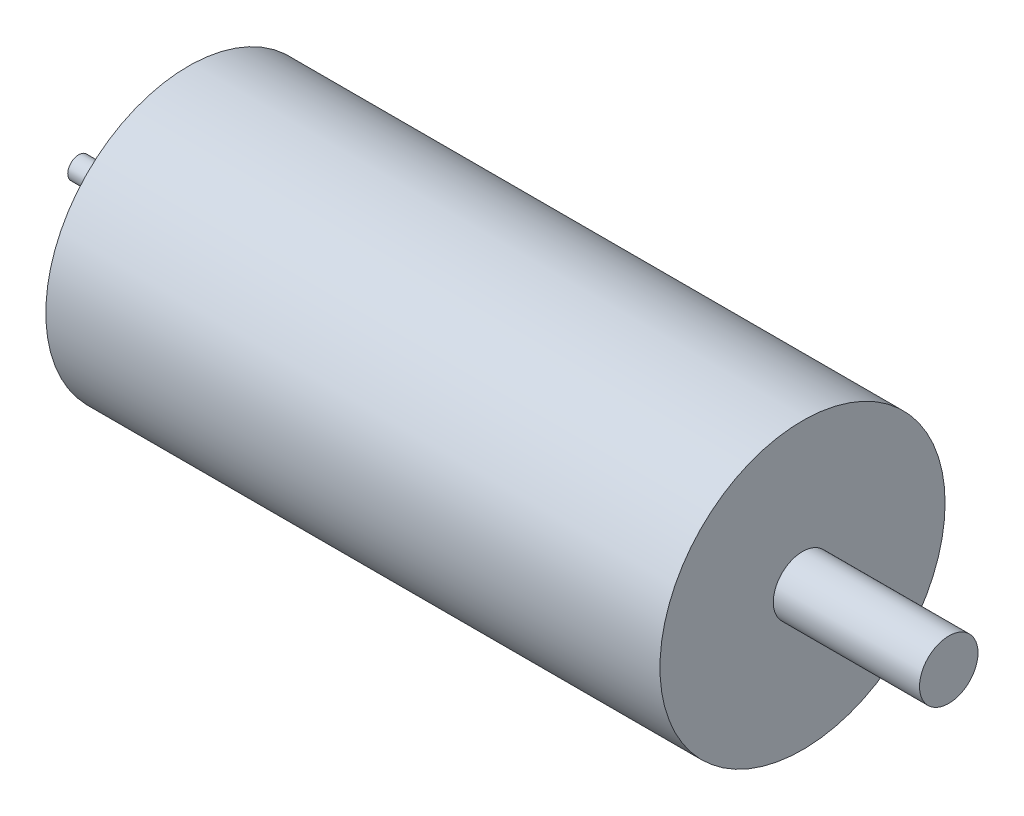
ISO-10303-21;
HEADER;
FILE_DESCRIPTION(('STEP AP214'),'2;1');
FILE_NAME('part.step','',(''),(''),'','','');
FILE_SCHEMA(('AUTOMOTIVE_DESIGN { 1 0 10303 214 1 1 1 1 }'));
ENDSEC;
DATA;
#1=APPLICATION_CONTEXT('core data for automotive mechanical design processes');
#2=APPLICATION_PROTOCOL_DEFINITION('international standard','automotive_design',2000,#1);
#3=PRODUCT_CONTEXT('',#1,'mechanical');
#4=PRODUCT('Part','Part','',(#3));
#5=PRODUCT_RELATED_PRODUCT_CATEGORY('part','',(#4));
#6=PRODUCT_DEFINITION_FORMATION('','',#4);
#7=PRODUCT_DEFINITION_CONTEXT('part definition',#1,'design');
#8=PRODUCT_DEFINITION('design','',#6,#7);
#9=PRODUCT_DEFINITION_SHAPE('','',#8);
#10=(LENGTH_UNIT() NAMED_UNIT(*) SI_UNIT(.MILLI.,.METRE.));
#11=(NAMED_UNIT(*) PLANE_ANGLE_UNIT() SI_UNIT($,.RADIAN.));
#12=(NAMED_UNIT(*) SI_UNIT($,.STERADIAN.) SOLID_ANGLE_UNIT());
#13=UNCERTAINTY_MEASURE_WITH_UNIT(LENGTH_MEASURE(1.E-05),#10,'distance_accuracy_value','');
#14=(GEOMETRIC_REPRESENTATION_CONTEXT(3) GLOBAL_UNCERTAINTY_ASSIGNED_CONTEXT((#13)) GLOBAL_UNIT_ASSIGNED_CONTEXT((#10,
#11,#12)) REPRESENTATION_CONTEXT('',''));
#15=CARTESIAN_POINT('',(0.,0.,0.));
#16=DIRECTION('',(0.,0.,1.));
#17=DIRECTION('',(1.,0.,0.));
#18=AXIS2_PLACEMENT_3D('',#15,#16,#17);
#19=CARTESIAN_POINT('',(84.,0.,0.));
#20=DIRECTION('',(-1.,0.,0.));
#21=DIRECTION('',(0.,0.,1.));
#22=AXIS2_PLACEMENT_3D('',#19,#20,#21);
#23=CYLINDRICAL_SURFACE('',#22,19.5);
#24=CARTESIAN_POINT('',(84.,0.,0.));
#25=DIRECTION('',(1.,0.,0.));
#26=DIRECTION('',(0.,0.,-1.));
#27=AXIS2_PLACEMENT_3D('',#24,#25,#26);
#28=CIRCLE('',#27,19.5);
#29=CARTESIAN_POINT('',(84.,0.,-19.5));
#30=VERTEX_POINT('',#29);
#31=EDGE_CURVE('E46',#30,#30,#28,.T.);
#32=ORIENTED_EDGE('',*,*,#31,.F.);
#33=EDGE_LOOP('',(#32));
#34=FACE_BOUND('',#33,.T.);
#35=CARTESIAN_POINT('',(0.,0.,0.));
#36=DIRECTION('',(1.,0.,0.));
#37=DIRECTION('',(0.,0.,-1.));
#38=AXIS2_PLACEMENT_3D('',#35,#36,#37);
#39=CIRCLE('',#38,19.5);
#40=CARTESIAN_POINT('',(0.,0.,-19.5));
#41=VERTEX_POINT('',#40);
#42=EDGE_CURVE('E51',#41,#41,#39,.T.);
#43=ORIENTED_EDGE('',*,*,#42,.T.);
#44=EDGE_LOOP('',(#43));
#45=FACE_BOUND('',#44,.T.);
#46=ADVANCED_FACE('F36',(#34,#45),#23,.T.);
#47=CARTESIAN_POINT('',(84.,0.,0.));
#48=DIRECTION('',(1.,0.,0.));
#49=DIRECTION('',(0.,0.,-1.));
#50=AXIS2_PLACEMENT_3D('',#47,#48,#49);
#51=PLANE('',#50);
#52=CARTESIAN_POINT('',(84.,0.,0.));
#53=DIRECTION('',(1.,0.,0.));
#54=DIRECTION('',(0.,0.,-1.));
#55=AXIS2_PLACEMENT_3D('',#52,#53,#54);
#56=CIRCLE('',#55,4.);
#57=CARTESIAN_POINT('',(84.,0.,-4.));
#58=VERTEX_POINT('',#57);
#59=EDGE_CURVE('E42',#58,#58,#56,.T.);
#60=ORIENTED_EDGE('',*,*,#59,.F.);
#61=EDGE_LOOP('',(#60));
#62=FACE_BOUND('',#61,.T.);
#63=ORIENTED_EDGE('',*,*,#31,.T.);
#64=EDGE_LOOP('',(#63));
#65=FACE_BOUND('',#64,.T.);
#66=ADVANCED_FACE('F80',(#62,#65),#51,.T.);
#67=CARTESIAN_POINT('',(0.,0.,0.));
#68=DIRECTION('',(1.,0.,0.));
#69=DIRECTION('',(0.,0.,-1.));
#70=AXIS2_PLACEMENT_3D('',#67,#68,#69);
#71=PLANE('',#70);
#72=CARTESIAN_POINT('',(0.,0.,0.));
#73=DIRECTION('',(1.,0.,0.));
#74=DIRECTION('',(0.,0.,-1.));
#75=AXIS2_PLACEMENT_3D('',#72,#73,#74);
#76=CIRCLE('',#75,1.5);
#77=CARTESIAN_POINT('',(0.,0.,-1.5));
#78=VERTEX_POINT('',#77);
#79=EDGE_CURVE('E10',#78,#78,#76,.F.);
#80=ORIENTED_EDGE('',*,*,#79,.F.);
#81=EDGE_LOOP('',(#80));
#82=FACE_BOUND('',#81,.T.);
#83=ORIENTED_EDGE('',*,*,#42,.F.);
#84=EDGE_LOOP('',(#83));
#85=FACE_BOUND('',#84,.T.);
#86=ADVANCED_FACE('F85',(#82,#85),#71,.F.);
#87=CARTESIAN_POINT('',(104.,0.,0.));
#88=DIRECTION('',(-1.,0.,0.));
#89=DIRECTION('',(0.,0.,1.));
#90=AXIS2_PLACEMENT_3D('',#87,#88,#89);
#91=CYLINDRICAL_SURFACE('',#90,4.);
#92=CARTESIAN_POINT('',(104.,0.,0.));
#93=DIRECTION('',(1.,0.,0.));
#94=DIRECTION('',(0.,0.,-1.));
#95=AXIS2_PLACEMENT_3D('',#92,#93,#94);
#96=CIRCLE('',#95,4.);
#97=CARTESIAN_POINT('',(104.,0.,-4.));
#98=VERTEX_POINT('',#97);
#99=EDGE_CURVE('E54',#98,#98,#96,.T.);
#100=ORIENTED_EDGE('',*,*,#99,.F.);
#101=EDGE_LOOP('',(#100));
#102=FACE_BOUND('',#101,.T.);
#103=ORIENTED_EDGE('',*,*,#59,.T.);
#104=EDGE_LOOP('',(#103));
#105=FACE_BOUND('',#104,.T.);
#106=ADVANCED_FACE('F77',(#102,#105),#91,.T.);
#107=CARTESIAN_POINT('',(104.,0.,0.));
#108=DIRECTION('',(1.,0.,0.));
#109=DIRECTION('',(0.,0.,-1.));
#110=AXIS2_PLACEMENT_3D('',#107,#108,#109);
#111=PLANE('',#110);
#112=ORIENTED_EDGE('',*,*,#99,.T.);
#113=EDGE_LOOP('',(#112));
#114=FACE_BOUND('',#113,.T.);
#115=ADVANCED_FACE('F70',(#114),#111,.T.);
#116=CARTESIAN_POINT('',(-15.,0.,0.));
#117=DIRECTION('',(1.,0.,0.));
#118=DIRECTION('',(0.,0.,-1.));
#119=AXIS2_PLACEMENT_3D('',#116,#117,#118);
#120=CYLINDRICAL_SURFACE('',#119,1.5);
#121=CARTESIAN_POINT('',(-15.,0.,0.));
#122=DIRECTION('',(-1.,0.,0.));
#123=DIRECTION('',(0.,0.,1.));
#124=AXIS2_PLACEMENT_3D('',#121,#122,#123);
#125=CIRCLE('',#124,1.5);
#126=CARTESIAN_POINT('',(-15.,0.,1.5));
#127=VERTEX_POINT('',#126);
#128=EDGE_CURVE('E60',#127,#127,#125,.T.);
#129=ORIENTED_EDGE('',*,*,#128,.F.);
#130=EDGE_LOOP('',(#129));
#131=FACE_BOUND('',#130,.T.);
#132=ORIENTED_EDGE('',*,*,#79,.T.);
#133=EDGE_LOOP('',(#132));
#134=FACE_BOUND('',#133,.T.);
#135=ADVANCED_FACE('F68',(#131,#134),#120,.T.);
#136=CARTESIAN_POINT('',(-15.,0.,0.));
#137=DIRECTION('',(-1.,0.,0.));
#138=DIRECTION('',(0.,0.,1.));
#139=AXIS2_PLACEMENT_3D('',#136,#137,#138);
#140=PLANE('',#139);
#141=ORIENTED_EDGE('',*,*,#128,.T.);
#142=EDGE_LOOP('',(#141));
#143=FACE_BOUND('',#142,.T.);
#144=ADVANCED_FACE('F66',(#143),#140,.T.);
#145=CLOSED_SHELL('',(#46,#66,#86,#106,#115,#135,#144));
#146=MANIFOLD_SOLID_BREP('B2',#145);
#147=ADVANCED_BREP_SHAPE_REPRESENTATION('',(#18,#146),#14);
#148=SHAPE_DEFINITION_REPRESENTATION(#9,#147);
ENDSEC;
END-ISO-10303-21;
